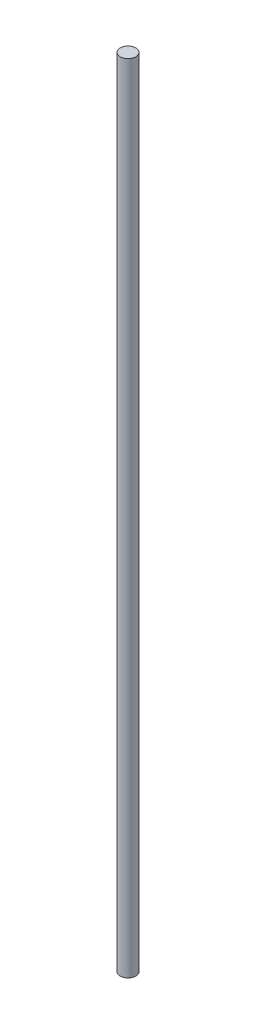
ISO-10303-21;
HEADER;
FILE_DESCRIPTION(('STEP AP214'),'2;1');
FILE_NAME('part.step','',(''),(''),'','','');
FILE_SCHEMA(('AUTOMOTIVE_DESIGN { 1 0 10303 214 1 1 1 1 }'));
ENDSEC;
DATA;
#1=APPLICATION_CONTEXT('core data for automotive mechanical design processes');
#2=APPLICATION_PROTOCOL_DEFINITION('international standard','automotive_design',2000,#1);
#3=PRODUCT_CONTEXT('',#1,'mechanical');
#4=PRODUCT('Part','Part','',(#3));
#5=PRODUCT_RELATED_PRODUCT_CATEGORY('part','',(#4));
#6=PRODUCT_DEFINITION_FORMATION('','',#4);
#7=PRODUCT_DEFINITION_CONTEXT('part definition',#1,'design');
#8=PRODUCT_DEFINITION('design','',#6,#7);
#9=PRODUCT_DEFINITION_SHAPE('','',#8);
#10=(LENGTH_UNIT() NAMED_UNIT(*) SI_UNIT(.MILLI.,.METRE.));
#11=(NAMED_UNIT(*) PLANE_ANGLE_UNIT() SI_UNIT($,.RADIAN.));
#12=(NAMED_UNIT(*) SI_UNIT($,.STERADIAN.) SOLID_ANGLE_UNIT());
#13=UNCERTAINTY_MEASURE_WITH_UNIT(LENGTH_MEASURE(1.E-05),#10,'distance_accuracy_value','');
#14=(GEOMETRIC_REPRESENTATION_CONTEXT(3) GLOBAL_UNCERTAINTY_ASSIGNED_CONTEXT((#13)) GLOBAL_UNIT_ASSIGNED_CONTEXT((#10,
#11,#12)) REPRESENTATION_CONTEXT('',''));
#15=CARTESIAN_POINT('',(0.,0.,0.));
#16=DIRECTION('',(0.,0.,1.));
#17=DIRECTION('',(1.,0.,0.));
#18=AXIS2_PLACEMENT_3D('',#15,#16,#17);
#19=CARTESIAN_POINT('',(0.,90.,0.));
#20=DIRECTION('',(0.,-1.,0.));
#21=DIRECTION('',(0.,0.,-1.));
#22=AXIS2_PLACEMENT_3D('',#19,#20,#21);
#23=CYLINDRICAL_SURFACE('',#22,0.875);
#24=CARTESIAN_POINT('',(0.,90.,0.));
#25=DIRECTION('',(0.,1.,0.));
#26=DIRECTION('',(0.,0.,1.));
#27=AXIS2_PLACEMENT_3D('',#24,#25,#26);
#28=CIRCLE('',#27,0.875);
#29=CARTESIAN_POINT('',(0.,90.,0.875));
#30=VERTEX_POINT('',#29);
#31=EDGE_CURVE('E10',#30,#30,#28,.T.);
#32=ORIENTED_EDGE('',*,*,#31,.F.);
#33=EDGE_LOOP('',(#32));
#34=FACE_BOUND('',#33,.T.);
#35=CARTESIAN_POINT('',(0.,0.,0.));
#36=DIRECTION('',(0.,1.,0.));
#37=DIRECTION('',(0.,0.,1.));
#38=AXIS2_PLACEMENT_3D('',#35,#36,#37);
#39=CIRCLE('',#38,0.875);
#40=CARTESIAN_POINT('',(0.,0.,0.875));
#41=VERTEX_POINT('',#40);
#42=EDGE_CURVE('E31',#41,#41,#39,.T.);
#43=ORIENTED_EDGE('',*,*,#42,.T.);
#44=EDGE_LOOP('',(#43));
#45=FACE_BOUND('',#44,.T.);
#46=ADVANCED_FACE('F28',(#34,#45),#23,.T.);
#47=CARTESIAN_POINT('',(0.,90.,0.));
#48=DIRECTION('',(0.,1.,0.));
#49=DIRECTION('',(0.,0.,1.));
#50=AXIS2_PLACEMENT_3D('',#47,#48,#49);
#51=PLANE('',#50);
#52=ORIENTED_EDGE('',*,*,#31,.T.);
#53=EDGE_LOOP('',(#52));
#54=FACE_BOUND('',#53,.T.);
#55=ADVANCED_FACE('F43',(#54),#51,.T.);
#56=CARTESIAN_POINT('',(0.,0.,0.));
#57=DIRECTION('',(0.,1.,0.));
#58=DIRECTION('',(0.,0.,1.));
#59=AXIS2_PLACEMENT_3D('',#56,#57,#58);
#60=PLANE('',#59);
#61=ORIENTED_EDGE('',*,*,#42,.F.);
#62=EDGE_LOOP('',(#61));
#63=FACE_BOUND('',#62,.T.);
#64=ADVANCED_FACE('F41',(#63),#60,.F.);
#65=CLOSED_SHELL('',(#46,#55,#64));
#66=MANIFOLD_SOLID_BREP('B2',#65);
#67=ADVANCED_BREP_SHAPE_REPRESENTATION('',(#18,#66),#14);
#68=SHAPE_DEFINITION_REPRESENTATION(#9,#67);
ENDSEC;
END-ISO-10303-21;
